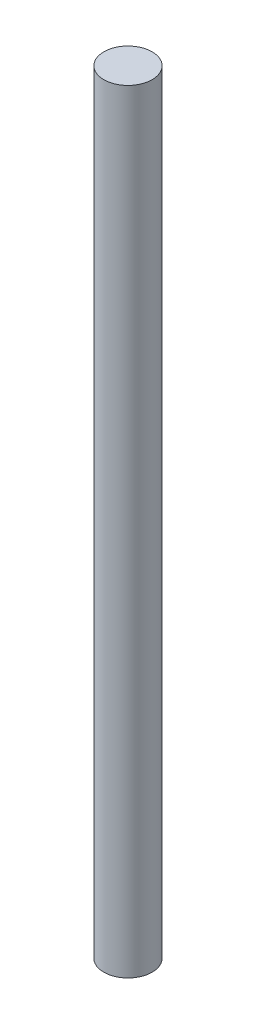
ISO-10303-21;
HEADER;
FILE_DESCRIPTION(('STEP AP214'),'2;1');
FILE_NAME('part.step','',(''),(''),'','','');
FILE_SCHEMA(('AUTOMOTIVE_DESIGN { 1 0 10303 214 1 1 1 1 }'));
ENDSEC;
DATA;
#1=APPLICATION_CONTEXT('core data for automotive mechanical design processes');
#2=APPLICATION_PROTOCOL_DEFINITION('international standard','automotive_design',2000,#1);
#3=PRODUCT_CONTEXT('',#1,'mechanical');
#4=PRODUCT('Part','Part','',(#3));
#5=PRODUCT_RELATED_PRODUCT_CATEGORY('part','',(#4));
#6=PRODUCT_DEFINITION_FORMATION('','',#4);
#7=PRODUCT_DEFINITION_CONTEXT('part definition',#1,'design');
#8=PRODUCT_DEFINITION('design','',#6,#7);
#9=PRODUCT_DEFINITION_SHAPE('','',#8);
#10=(LENGTH_UNIT() NAMED_UNIT(*) SI_UNIT(.MILLI.,.METRE.));
#11=(NAMED_UNIT(*) PLANE_ANGLE_UNIT() SI_UNIT($,.RADIAN.));
#12=(NAMED_UNIT(*) SI_UNIT($,.STERADIAN.) SOLID_ANGLE_UNIT());
#13=UNCERTAINTY_MEASURE_WITH_UNIT(LENGTH_MEASURE(1.E-05),#10,'distance_accuracy_value','');
#14=(GEOMETRIC_REPRESENTATION_CONTEXT(3) GLOBAL_UNCERTAINTY_ASSIGNED_CONTEXT((#13)) GLOBAL_UNIT_ASSIGNED_CONTEXT((#10,
#11,#12)) REPRESENTATION_CONTEXT('',''));
#15=CARTESIAN_POINT('',(0.,0.,0.));
#16=DIRECTION('',(0.,0.,1.));
#17=DIRECTION('',(1.,0.,0.));
#18=AXIS2_PLACEMENT_3D('',#15,#16,#17);
#19=CARTESIAN_POINT('',(0.,101.6,0.));
#20=DIRECTION('',(0.,-1.,0.));
#21=DIRECTION('',(0.,0.,-1.));
#22=AXIS2_PLACEMENT_3D('',#19,#20,#21);
#23=CYLINDRICAL_SURFACE('',#22,3.175);
#24=CARTESIAN_POINT('',(0.,101.6,0.));
#25=DIRECTION('',(0.,1.,0.));
#26=DIRECTION('',(0.,0.,1.));
#27=AXIS2_PLACEMENT_3D('',#24,#25,#26);
#28=CIRCLE('',#27,3.175);
#29=CARTESIAN_POINT('',(0.,101.6,3.175));
#30=VERTEX_POINT('',#29);
#31=EDGE_CURVE('E10',#30,#30,#28,.T.);
#32=ORIENTED_EDGE('',*,*,#31,.F.);
#33=EDGE_LOOP('',(#32));
#34=FACE_BOUND('',#33,.T.);
#35=CARTESIAN_POINT('',(0.,0.,0.));
#36=DIRECTION('',(0.,1.,0.));
#37=DIRECTION('',(0.,0.,1.));
#38=AXIS2_PLACEMENT_3D('',#35,#36,#37);
#39=CIRCLE('',#38,3.175);
#40=CARTESIAN_POINT('',(0.,0.,3.175));
#41=VERTEX_POINT('',#40);
#42=EDGE_CURVE('E33',#41,#41,#39,.T.);
#43=ORIENTED_EDGE('',*,*,#42,.T.);
#44=EDGE_LOOP('',(#43));
#45=FACE_BOUND('',#44,.T.);
#46=ADVANCED_FACE('F30',(#34,#45),#23,.T.);
#47=CARTESIAN_POINT('',(0.,101.6,0.));
#48=DIRECTION('',(0.,1.,0.));
#49=DIRECTION('',(0.,0.,1.));
#50=AXIS2_PLACEMENT_3D('',#47,#48,#49);
#51=PLANE('',#50);
#52=ORIENTED_EDGE('',*,*,#31,.T.);
#53=EDGE_LOOP('',(#52));
#54=FACE_BOUND('',#53,.T.);
#55=ADVANCED_FACE('F45',(#54),#51,.T.);
#56=CARTESIAN_POINT('',(0.,0.,0.));
#57=DIRECTION('',(0.,1.,0.));
#58=DIRECTION('',(0.,0.,1.));
#59=AXIS2_PLACEMENT_3D('',#56,#57,#58);
#60=PLANE('',#59);
#61=ORIENTED_EDGE('',*,*,#42,.F.);
#62=EDGE_LOOP('',(#61));
#63=FACE_BOUND('',#62,.T.);
#64=ADVANCED_FACE('F43',(#63),#60,.F.);
#65=CLOSED_SHELL('',(#46,#55,#64));
#66=MANIFOLD_SOLID_BREP('B2',#65);
#67=ADVANCED_BREP_SHAPE_REPRESENTATION('',(#18,#66),#14);
#68=SHAPE_DEFINITION_REPRESENTATION(#9,#67);
ENDSEC;
END-ISO-10303-21;
